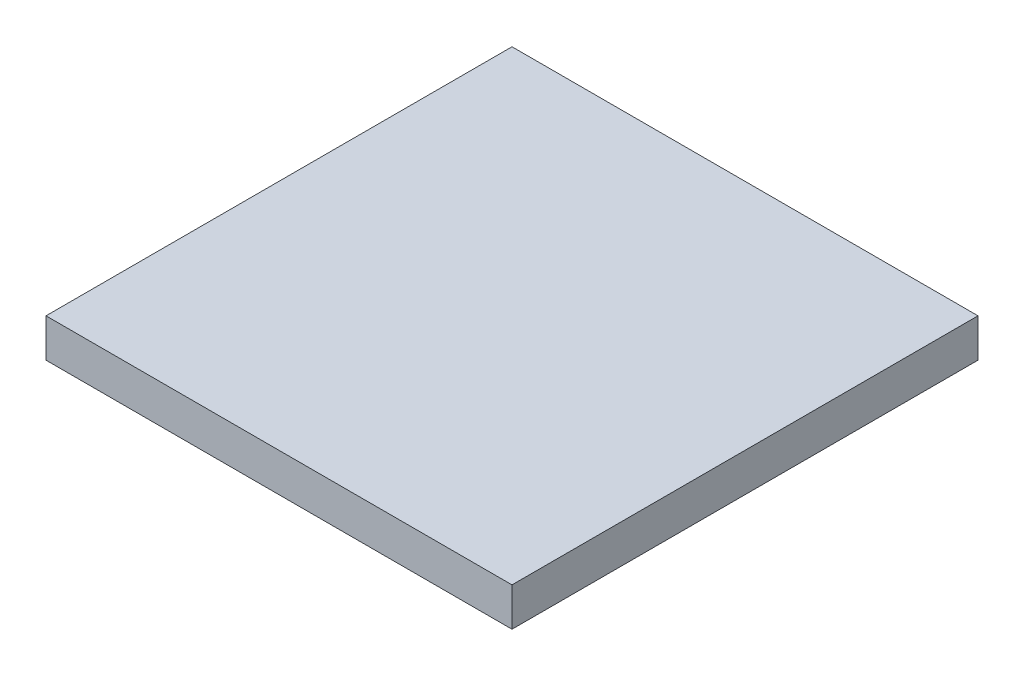
ISO-10303-21;
HEADER;
FILE_DESCRIPTION(('STEP AP214'),'2;1');
FILE_NAME('part.step','',(''),(''),'','','');
FILE_SCHEMA(('AUTOMOTIVE_DESIGN { 1 0 10303 214 1 1 1 1 }'));
ENDSEC;
DATA;
#1=APPLICATION_CONTEXT('core data for automotive mechanical design processes');
#2=APPLICATION_PROTOCOL_DEFINITION('international standard','automotive_design',2000,#1);
#3=PRODUCT_CONTEXT('',#1,'mechanical');
#4=PRODUCT('Part','Part','',(#3));
#5=PRODUCT_RELATED_PRODUCT_CATEGORY('part','',(#4));
#6=PRODUCT_DEFINITION_FORMATION('','',#4);
#7=PRODUCT_DEFINITION_CONTEXT('part definition',#1,'design');
#8=PRODUCT_DEFINITION('design','',#6,#7);
#9=PRODUCT_DEFINITION_SHAPE('','',#8);
#10=(LENGTH_UNIT() NAMED_UNIT(*) SI_UNIT(.MILLI.,.METRE.));
#11=(NAMED_UNIT(*) PLANE_ANGLE_UNIT() SI_UNIT($,.RADIAN.));
#12=(NAMED_UNIT(*) SI_UNIT($,.STERADIAN.) SOLID_ANGLE_UNIT());
#13=UNCERTAINTY_MEASURE_WITH_UNIT(LENGTH_MEASURE(1.E-05),#10,'distance_accuracy_value','');
#14=(GEOMETRIC_REPRESENTATION_CONTEXT(3) GLOBAL_UNCERTAINTY_ASSIGNED_CONTEXT((#13)) GLOBAL_UNIT_ASSIGNED_CONTEXT((#10,
#11,#12)) REPRESENTATION_CONTEXT('',''));
#15=CARTESIAN_POINT('',(0.,0.,0.));
#16=DIRECTION('',(0.,0.,1.));
#17=DIRECTION('',(1.,0.,0.));
#18=AXIS2_PLACEMENT_3D('',#15,#16,#17);
#19=CARTESIAN_POINT('',(20.,3.3,20.));
#20=DIRECTION('',(-1.,0.,0.));
#21=DIRECTION('',(0.,0.,1.));
#22=AXIS2_PLACEMENT_3D('',#19,#20,#21);
#23=PLANE('',#22);
#24=DIRECTION('',(0.,0.,-1.));
#25=VECTOR('',#24,1.);
#26=CARTESIAN_POINT('',(20.,0.,20.));
#27=LINE('',#26,#25);
#28=CARTESIAN_POINT('',(20.,0.,20.));
#29=VERTEX_POINT('',#28);
#30=CARTESIAN_POINT('',(20.,0.,-20.));
#31=VERTEX_POINT('',#30);
#32=EDGE_CURVE('E102',#29,#31,#27,.T.);
#33=ORIENTED_EDGE('',*,*,#32,.T.);
#34=DIRECTION('',(0.,-1.,0.));
#35=VECTOR('',#34,1.);
#36=CARTESIAN_POINT('',(20.,3.3,-20.));
#37=LINE('',#36,#35);
#38=CARTESIAN_POINT('',(20.,3.3,-20.));
#39=VERTEX_POINT('',#38);
#40=EDGE_CURVE('E11',#39,#31,#37,.T.);
#41=ORIENTED_EDGE('',*,*,#40,.F.);
#42=DIRECTION('',(0.,0.,-1.));
#43=VECTOR('',#42,1.);
#44=CARTESIAN_POINT('',(20.,3.3,20.));
#45=LINE('',#44,#43);
#46=CARTESIAN_POINT('',(20.,3.3,20.));
#47=VERTEX_POINT('',#46);
#48=EDGE_CURVE('E90',#47,#39,#45,.T.);
#49=ORIENTED_EDGE('',*,*,#48,.F.);
#50=DIRECTION('',(0.,-1.,0.));
#51=VECTOR('',#50,1.);
#52=CARTESIAN_POINT('',(20.,3.3,20.));
#53=LINE('',#52,#51);
#54=EDGE_CURVE('E98',#47,#29,#53,.T.);
#55=ORIENTED_EDGE('',*,*,#54,.T.);
#56=EDGE_LOOP('',(#33,#41,#49,#55));
#57=FACE_BOUND('',#56,.T.);
#58=ADVANCED_FACE('F39',(#57),#23,.F.);
#59=CARTESIAN_POINT('',(-20.,3.3,-20.));
#60=DIRECTION('',(0.,0.,1.));
#61=DIRECTION('',(1.,0.,0.));
#62=AXIS2_PLACEMENT_3D('',#59,#60,#61);
#63=PLANE('',#62);
#64=DIRECTION('',(-1.,0.,0.));
#65=VECTOR('',#64,1.);
#66=CARTESIAN_POINT('',(-20.,0.,-20.));
#67=LINE('',#66,#65);
#68=CARTESIAN_POINT('',(-20.,0.,-20.));
#69=VERTEX_POINT('',#68);
#70=EDGE_CURVE('E94',#31,#69,#67,.T.);
#71=ORIENTED_EDGE('',*,*,#70,.T.);
#72=DIRECTION('',(0.,-1.,0.));
#73=VECTOR('',#72,1.);
#74=CARTESIAN_POINT('',(-20.,3.3,-20.));
#75=LINE('',#74,#73);
#76=CARTESIAN_POINT('',(-20.,3.3,-20.));
#77=VERTEX_POINT('',#76);
#78=EDGE_CURVE('E47',#77,#69,#75,.T.);
#79=ORIENTED_EDGE('',*,*,#78,.F.);
#80=DIRECTION('',(-1.,0.,0.));
#81=VECTOR('',#80,1.);
#82=CARTESIAN_POINT('',(-20.,3.3,-20.));
#83=LINE('',#82,#81);
#84=EDGE_CURVE('E85',#39,#77,#83,.T.);
#85=ORIENTED_EDGE('',*,*,#84,.F.);
#86=ORIENTED_EDGE('',*,*,#40,.T.);
#87=EDGE_LOOP('',(#71,#79,#85,#86));
#88=FACE_BOUND('',#87,.T.);
#89=ADVANCED_FACE('F93',(#88),#63,.F.);
#90=CARTESIAN_POINT('',(-20.,3.3,20.));
#91=DIRECTION('',(1.,0.,0.));
#92=DIRECTION('',(0.,0.,-1.));
#93=AXIS2_PLACEMENT_3D('',#90,#91,#92);
#94=PLANE('',#93);
#95=DIRECTION('',(0.,0.,1.));
#96=VECTOR('',#95,1.);
#97=CARTESIAN_POINT('',(-20.,0.,20.));
#98=LINE('',#97,#96);
#99=CARTESIAN_POINT('',(-20.,0.,20.));
#100=VERTEX_POINT('',#99);
#101=EDGE_CURVE('E72',#69,#100,#98,.T.);
#102=ORIENTED_EDGE('',*,*,#101,.T.);
#103=DIRECTION('',(0.,-1.,0.));
#104=VECTOR('',#103,1.);
#105=CARTESIAN_POINT('',(-20.,3.3,20.));
#106=LINE('',#105,#104);
#107=CARTESIAN_POINT('',(-20.,3.3,20.));
#108=VERTEX_POINT('',#107);
#109=EDGE_CURVE('E95',#108,#100,#106,.T.);
#110=ORIENTED_EDGE('',*,*,#109,.F.);
#111=DIRECTION('',(0.,0.,1.));
#112=VECTOR('',#111,1.);
#113=CARTESIAN_POINT('',(-20.,3.3,20.));
#114=LINE('',#113,#112);
#115=EDGE_CURVE('E88',#77,#108,#114,.T.);
#116=ORIENTED_EDGE('',*,*,#115,.F.);
#117=ORIENTED_EDGE('',*,*,#78,.T.);
#118=EDGE_LOOP('',(#102,#110,#116,#117));
#119=FACE_BOUND('',#118,.T.);
#120=ADVANCED_FACE('F96',(#119),#94,.F.);
#121=CARTESIAN_POINT('',(-20.,3.3,20.));
#122=DIRECTION('',(0.,0.,-1.));
#123=DIRECTION('',(-1.,0.,0.));
#124=AXIS2_PLACEMENT_3D('',#121,#122,#123);
#125=PLANE('',#124);
#126=DIRECTION('',(1.,0.,0.));
#127=VECTOR('',#126,1.);
#128=CARTESIAN_POINT('',(-20.,0.,20.));
#129=LINE('',#128,#127);
#130=EDGE_CURVE('E78',#100,#29,#129,.T.);
#131=ORIENTED_EDGE('',*,*,#130,.T.);
#132=ORIENTED_EDGE('',*,*,#54,.F.);
#133=DIRECTION('',(1.,0.,0.));
#134=VECTOR('',#133,1.);
#135=CARTESIAN_POINT('',(-20.,3.3,20.));
#136=LINE('',#135,#134);
#137=EDGE_CURVE('E55',#108,#47,#136,.T.);
#138=ORIENTED_EDGE('',*,*,#137,.F.);
#139=ORIENTED_EDGE('',*,*,#109,.T.);
#140=EDGE_LOOP('',(#131,#132,#138,#139));
#141=FACE_BOUND('',#140,.T.);
#142=ADVANCED_FACE('F109',(#141),#125,.F.);
#143=CARTESIAN_POINT('',(0.,3.3,0.));
#144=DIRECTION('',(0.,-1.,0.));
#145=DIRECTION('',(0.,0.,-1.));
#146=AXIS2_PLACEMENT_3D('',#143,#144,#145);
#147=PLANE('',#146);
#148=ORIENTED_EDGE('',*,*,#48,.T.);
#149=ORIENTED_EDGE('',*,*,#84,.T.);
#150=ORIENTED_EDGE('',*,*,#115,.T.);
#151=ORIENTED_EDGE('',*,*,#137,.T.);
#152=EDGE_LOOP('',(#148,#149,#150,#151));
#153=FACE_BOUND('',#152,.T.);
#154=ADVANCED_FACE('F86',(#153),#147,.F.);
#155=CARTESIAN_POINT('',(0.,0.,0.));
#156=DIRECTION('',(0.,-1.,0.));
#157=DIRECTION('',(0.,0.,-1.));
#158=AXIS2_PLACEMENT_3D('',#155,#156,#157);
#159=PLANE('',#158);
#160=ORIENTED_EDGE('',*,*,#32,.F.);
#161=ORIENTED_EDGE('',*,*,#130,.F.);
#162=ORIENTED_EDGE('',*,*,#101,.F.);
#163=ORIENTED_EDGE('',*,*,#70,.F.);
#164=EDGE_LOOP('',(#160,#161,#162,#163));
#165=FACE_BOUND('',#164,.T.);
#166=ADVANCED_FACE('F112',(#165),#159,.T.);
#167=CLOSED_SHELL('',(#58,#89,#120,#142,#154,#166));
#168=MANIFOLD_SOLID_BREP('B2',#167);
#169=ADVANCED_BREP_SHAPE_REPRESENTATION('',(#18,#168),#14);
#170=SHAPE_DEFINITION_REPRESENTATION(#9,#169);
ENDSEC;
END-ISO-10303-21;
